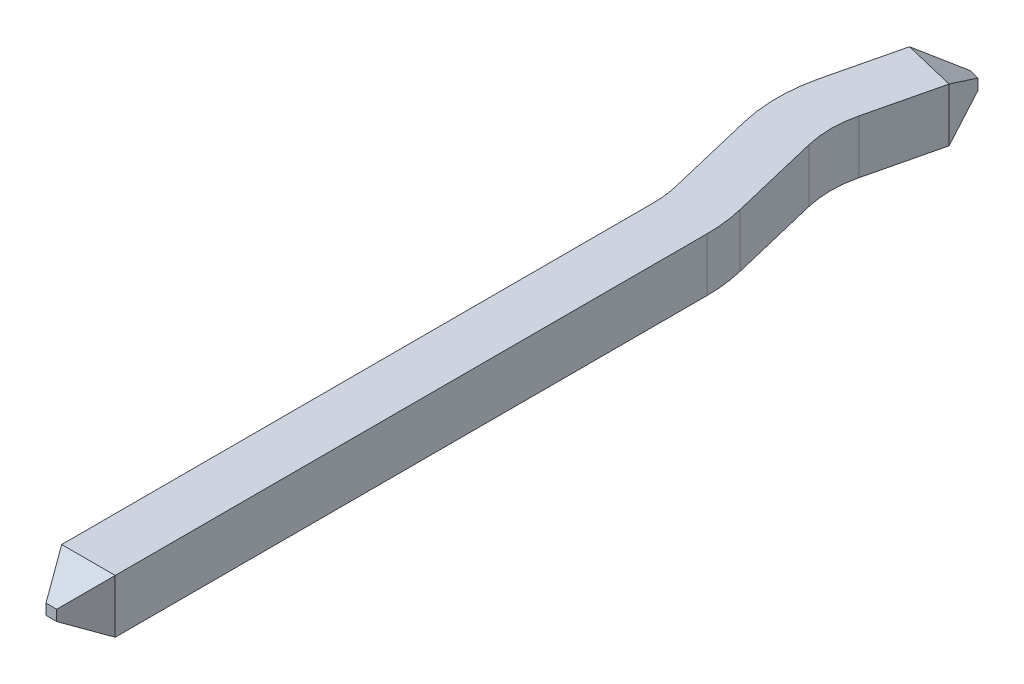
ISO-10303-21;
HEADER;
FILE_DESCRIPTION(('STEP AP214'),'2;1');
FILE_NAME('part.step','',(''),(''),'','','');
FILE_SCHEMA(('AUTOMOTIVE_DESIGN { 1 0 10303 214 1 1 1 1 }'));
ENDSEC;
DATA;
#1=APPLICATION_CONTEXT('core data for automotive mechanical design processes');
#2=APPLICATION_PROTOCOL_DEFINITION('international standard','automotive_design',2000,#1);
#3=PRODUCT_CONTEXT('',#1,'mechanical');
#4=PRODUCT('Part','Part','',(#3));
#5=PRODUCT_RELATED_PRODUCT_CATEGORY('part','',(#4));
#6=PRODUCT_DEFINITION_FORMATION('','',#4);
#7=PRODUCT_DEFINITION_CONTEXT('part definition',#1,'design');
#8=PRODUCT_DEFINITION('design','',#6,#7);
#9=PRODUCT_DEFINITION_SHAPE('','',#8);
#10=(LENGTH_UNIT() NAMED_UNIT(*) SI_UNIT(.MILLI.,.METRE.));
#11=(NAMED_UNIT(*) PLANE_ANGLE_UNIT() SI_UNIT($,.RADIAN.));
#12=(NAMED_UNIT(*) SI_UNIT($,.STERADIAN.) SOLID_ANGLE_UNIT());
#13=UNCERTAINTY_MEASURE_WITH_UNIT(LENGTH_MEASURE(1.E-05),#10,'distance_accuracy_value','');
#14=(GEOMETRIC_REPRESENTATION_CONTEXT(3) GLOBAL_UNCERTAINTY_ASSIGNED_CONTEXT((#13)) GLOBAL_UNIT_ASSIGNED_CONTEXT((#10,
#11,#12)) REPRESENTATION_CONTEXT('',''));
#15=CARTESIAN_POINT('',(0.,0.,0.));
#16=DIRECTION('',(0.,0.,1.));
#17=DIRECTION('',(1.,0.,0.));
#18=AXIS2_PLACEMENT_3D('',#15,#16,#17);
#19=CARTESIAN_POINT('',(0.,-0.05,-2.5));
#20=DIRECTION('',(0.116686476238054,-0.866025403784404,-0.486193650990227));
#21=DIRECTION('',(0.,0.489537781242464,-0.871982087394119));
#22=AXIS2_PLACEMENT_3D('',#19,#20,#21);
#23=PLANE('',#22);
#24=DIRECTION('',(-0.254094909858439,0.447213595500052,-0.857575522495801));
#25=VECTOR('',#24,1.);
#26=CARTESIAN_POINT('',(-0.0808427621599936,-0.25,-2.16315515766698));
#27=LINE('',#26,#25);
#28=CARTESIAN_POINT('',(-0.0808427621601337,-0.25,-2.16315515766704));
#29=VERTEX_POINT('',#28);
#30=CARTESIAN_POINT('',(-0.194477460396004,-0.0500000000000001,-2.54667459049498));
#31=VERTEX_POINT('',#30);
#32=EDGE_CURVE('E131',#29,#31,#27,.T.);
#33=ORIENTED_EDGE('',*,*,#32,.F.);
#34=DIRECTION('',(-0.972387301980345,0.,-0.233372952476041));
#35=VECTOR('',#34,1.);
#36=CARTESIAN_POINT('',(-0.08084276215992,-0.25,-2.163155157667));
#37=LINE('',#36,#35);
#38=CARTESIAN_POINT('',(-0.567036413150236,-0.25,-2.27984163390506));
#39=VERTEX_POINT('',#38);
#40=EDGE_CURVE('E188',#29,#39,#37,.T.);
#41=ORIENTED_EDGE('',*,*,#40,.T.);
#42=DIRECTION('',(0.615634733215566,0.447213595499943,-0.648840408157979));
#43=VECTOR('',#42,1.);
#44=CARTESIAN_POINT('',(-0.56703641315,-0.25,-2.279841633905));
#45=LINE('',#44,#43);
#46=CARTESIAN_POINT('',(-0.291716190594043,-0.0500000000000001,-2.57001188574282));
#47=VERTEX_POINT('',#46);
#48=EDGE_CURVE('E134',#39,#47,#45,.T.);
#49=ORIENTED_EDGE('',*,*,#48,.T.);
#50=DIRECTION('',(-0.972387301980617,0.,-0.233372952474908));
#51=VECTOR('',#50,1.);
#52=CARTESIAN_POINT('',(0.,-0.0500000000000001,-2.5));
#53=LINE('',#52,#51);
#54=EDGE_CURVE('E127',#31,#47,#53,.T.);
#55=ORIENTED_EDGE('',*,*,#54,.F.);
#56=EDGE_LOOP('',(#33,#41,#49,#55));
#57=FACE_BOUND('',#56,.T.);
#58=ADVANCED_FACE('F17',(#57),#23,.T.);
#59=CARTESIAN_POINT('',(0.,-0.25,5.703589838486));
#60=DIRECTION('',(0.,0.866025403784329,-0.50000000000019));
#61=DIRECTION('',(0.,0.50000000000019,0.866025403784329));
#62=AXIS2_PLACEMENT_3D('',#59,#60,#61);
#63=PLANE('',#62);
#64=DIRECTION('',(-1.,0.,0.));
#65=VECTOR('',#64,1.);
#66=CARTESIAN_POINT('',(0.,-0.05,6.05));
#67=LINE('',#66,#65);
#68=CARTESIAN_POINT('',(-0.200000000000116,-0.05,6.04999999999993));
#69=VERTEX_POINT('',#68);
#70=CARTESIAN_POINT('',(-0.3,-0.05,6.05));
#71=VERTEX_POINT('',#70);
#72=EDGE_CURVE('E157',#69,#71,#67,.T.);
#73=ORIENTED_EDGE('',*,*,#72,.T.);
#74=DIRECTION('',(0.447213595500171,0.447213595499784,0.774596669241461));
#75=VECTOR('',#74,1.);
#76=CARTESIAN_POINT('',(-0.500000000000173,-0.25,5.7035898384861));
#77=LINE('',#76,#75);
#78=CARTESIAN_POINT('',(-0.500000000000043,-0.25,5.70358983848602));
#79=VERTEX_POINT('',#78);
#80=EDGE_CURVE('E160',#79,#71,#77,.T.);
#81=ORIENTED_EDGE('',*,*,#80,.F.);
#82=DIRECTION('',(1.,0.,0.));
#83=VECTOR('',#82,1.);
#84=CARTESIAN_POINT('',(0.,-0.25,5.703589838486));
#85=LINE('',#84,#83);
#86=CARTESIAN_POINT('',(0.,-0.25,5.703589838486));
#87=VERTEX_POINT('',#86);
#88=EDGE_CURVE('E99',#79,#87,#85,.T.);
#89=ORIENTED_EDGE('',*,*,#88,.T.);
#90=DIRECTION('',(-0.447213595500171,0.447213595499784,0.774596669241461));
#91=VECTOR('',#90,1.);
#92=CARTESIAN_POINT('',(0.,-0.25,5.703589838486));
#93=LINE('',#92,#91);
#94=EDGE_CURVE('E217',#87,#69,#93,.T.);
#95=ORIENTED_EDGE('',*,*,#94,.T.);
#96=EDGE_LOOP('',(#73,#81,#89,#95));
#97=FACE_BOUND('',#96,.T.);
#98=ADVANCED_FACE('F265',(#97),#63,.F.);
#99=CARTESIAN_POINT('',(0.,0.25,-2.5));
#100=DIRECTION('',(0.233372952474908,0.,-0.972387301980617));
#101=DIRECTION('',(-0.972387301980617,0.,-0.233372952474908));
#102=AXIS2_PLACEMENT_3D('',#99,#100,#101);
#103=PLANE('',#102);
#104=DIRECTION('',(0.,1.,0.));
#105=VECTOR('',#104,1.);
#106=CARTESIAN_POINT('',(-0.194477460396,0.25,-2.546674590495));
#107=LINE('',#106,#105);
#108=CARTESIAN_POINT('',(-0.194477460395994,0.0500000000000671,-2.54667459049502));
#109=VERTEX_POINT('',#108);
#110=EDGE_CURVE('E138',#31,#109,#107,.T.);
#111=ORIENTED_EDGE('',*,*,#110,.F.);
#112=ORIENTED_EDGE('',*,*,#54,.T.);
#113=DIRECTION('',(0.,1.,0.));
#114=VECTOR('',#113,1.);
#115=CARTESIAN_POINT('',(-0.291716190594,0.25,-2.570011885743));
#116=LINE('',#115,#114);
#117=CARTESIAN_POINT('',(-0.291716190594009,0.0499999999998985,-2.57001188574296));
#118=VERTEX_POINT('',#117);
#119=EDGE_CURVE('E145',#47,#118,#116,.T.);
#120=ORIENTED_EDGE('',*,*,#119,.T.);
#121=DIRECTION('',(0.972387301979655,1.68505346394882E-12,0.233372952478918));
#122=VECTOR('',#121,1.);
#123=CARTESIAN_POINT('',(-0.291716190594014,0.0499999999998985,-2.57001188574294));
#124=LINE('',#123,#122);
#125=EDGE_CURVE('E141',#118,#109,#124,.T.);
#126=ORIENTED_EDGE('',*,*,#125,.T.);
#127=EDGE_LOOP('',(#111,#112,#120,#126));
#128=FACE_BOUND('',#127,.T.);
#129=ADVANCED_FACE('F139',(#128),#103,.T.);
#130=CARTESIAN_POINT('',(-0.194477460396,0.25,-2.546674590495));
#131=DIRECTION('',(0.958798582070307,0.,-0.284086745590091));
#132=DIRECTION('',(-0.284086745590091,0.,-0.958798582070307));
#133=AXIS2_PLACEMENT_3D('',#130,#131,#132);
#134=PLANE('',#133);
#135=ORIENTED_EDGE('',*,*,#32,.T.);
#136=ORIENTED_EDGE('',*,*,#110,.T.);
#137=DIRECTION('',(0.254094909858584,0.447213595499902,0.857575522495837));
#138=VECTOR('',#137,1.);
#139=CARTESIAN_POINT('',(-0.194477460395991,0.0500000000000671,-2.54667459049504));
#140=LINE('',#139,#138);
#141=CARTESIAN_POINT('',(-0.0808427621600177,0.25,-2.16315515766702));
#142=VERTEX_POINT('',#141);
#143=EDGE_CURVE('E246',#109,#142,#140,.T.);
#144=ORIENTED_EDGE('',*,*,#143,.T.);
#145=DIRECTION('',(0.,1.,0.));
#146=VECTOR('',#145,1.);
#147=CARTESIAN_POINT('',(-0.0808427621603106,0.25,-2.16315515766709));
#148=LINE('',#147,#146);
#149=EDGE_CURVE('E149',#142,#29,#148,.F.);
#150=ORIENTED_EDGE('',*,*,#149,.T.);
#151=EDGE_LOOP('',(#135,#136,#144,#150));
#152=FACE_BOUND('',#151,.T.);
#153=ADVANCED_FACE('F147',(#152),#134,.T.);
#154=CARTESIAN_POINT('',(-0.56703641315,0.25,-2.279841633905));
#155=DIRECTION('',(0.725425629594969,0.,0.68830055638997));
#156=DIRECTION('',(0.68830055638997,0.,-0.725425629594969));
#157=AXIS2_PLACEMENT_3D('',#154,#155,#156);
#158=PLANE('',#157);
#159=DIRECTION('',(0.,1.,0.));
#160=VECTOR('',#159,1.);
#161=CARTESIAN_POINT('',(-0.567036413150315,0.25,-2.27984163390508));
#162=LINE('',#161,#160);
#163=CARTESIAN_POINT('',(-0.567036413150079,0.250000000000002,-2.27984163390502));
#164=VERTEX_POINT('',#163);
#165=EDGE_CURVE('E234',#164,#39,#162,.F.);
#166=ORIENTED_EDGE('',*,*,#165,.F.);
#167=DIRECTION('',(0.615634733215533,-0.447213595500188,-0.648840408157841));
#168=VECTOR('',#167,1.);
#169=CARTESIAN_POINT('',(-0.567036413149999,0.250000000000008,-2.279841633905));
#170=LINE('',#169,#168);
#171=EDGE_CURVE('E249',#164,#118,#170,.T.);
#172=ORIENTED_EDGE('',*,*,#171,.T.);
#173=ORIENTED_EDGE('',*,*,#119,.F.);
#174=ORIENTED_EDGE('',*,*,#48,.F.);
#175=EDGE_LOOP('',(#166,#172,#173,#174));
#176=FACE_BOUND('',#175,.T.);
#177=ADVANCED_FACE('F342',(#176),#158,.F.);
#178=CARTESIAN_POINT('',(-0.3,0.25,6.05));
#179=DIRECTION('',(-0.866025403784329,0.,0.50000000000019));
#180=DIRECTION('',(0.50000000000019,0.,0.866025403784329));
#181=AXIS2_PLACEMENT_3D('',#178,#179,#180);
#182=PLANE('',#181);
#183=ORIENTED_EDGE('',*,*,#80,.T.);
#184=DIRECTION('',(0.,1.,0.));
#185=VECTOR('',#184,1.);
#186=CARTESIAN_POINT('',(-0.3,0.25,6.05));
#187=LINE('',#186,#185);
#188=CARTESIAN_POINT('',(-0.3,0.05,6.05));
#189=VERTEX_POINT('',#188);
#190=EDGE_CURVE('E159',#71,#189,#187,.T.);
#191=ORIENTED_EDGE('',*,*,#190,.T.);
#192=DIRECTION('',(0.447213595499784,-0.447213595500171,0.774596669241461));
#193=VECTOR('',#192,1.);
#194=CARTESIAN_POINT('',(-0.5,0.250000000000173,5.7035898384861));
#195=LINE('',#194,#193);
#196=CARTESIAN_POINT('',(-0.5,0.250000000000043,5.70358983848602));
#197=VERTEX_POINT('',#196);
#198=EDGE_CURVE('E209',#197,#189,#195,.T.);
#199=ORIENTED_EDGE('',*,*,#198,.F.);
#200=DIRECTION('',(0.,1.,0.));
#201=VECTOR('',#200,1.);
#202=CARTESIAN_POINT('',(-0.5,0.25,5.703589838486));
#203=LINE('',#202,#201);
#204=EDGE_CURVE('E222',#79,#197,#203,.T.);
#205=ORIENTED_EDGE('',*,*,#204,.F.);
#206=EDGE_LOOP('',(#183,#191,#199,#205));
#207=FACE_BOUND('',#206,.T.);
#208=ADVANCED_FACE('F280',(#207),#182,.T.);
#209=CARTESIAN_POINT('',(0.,0.25,6.05));
#210=DIRECTION('',(0.,0.,-1.));
#211=DIRECTION('',(-1.,0.,0.));
#212=AXIS2_PLACEMENT_3D('',#209,#210,#211);
#213=PLANE('',#212);
#214=ORIENTED_EDGE('',*,*,#190,.F.);
#215=ORIENTED_EDGE('',*,*,#72,.F.);
#216=DIRECTION('',(0.,1.,0.));
#217=VECTOR('',#216,1.);
#218=CARTESIAN_POINT('',(-0.200000000000173,0.25,6.0499999999999));
#219=LINE('',#218,#217);
#220=CARTESIAN_POINT('',(-0.200000000000058,0.05,6.04999999999997));
#221=VERTEX_POINT('',#220);
#222=EDGE_CURVE('E194',#69,#221,#219,.T.);
#223=ORIENTED_EDGE('',*,*,#222,.T.);
#224=DIRECTION('',(1.,0.,0.));
#225=VECTOR('',#224,1.);
#226=CARTESIAN_POINT('',(0.,0.05,6.05));
#227=LINE('',#226,#225);
#228=EDGE_CURVE('E205',#189,#221,#227,.T.);
#229=ORIENTED_EDGE('',*,*,#228,.F.);
#230=EDGE_LOOP('',(#214,#215,#223,#229));
#231=FACE_BOUND('',#230,.T.);
#232=ADVANCED_FACE('F276',(#231),#213,.F.);
#233=CARTESIAN_POINT('',(0.,-0.25,6.05));
#234=DIRECTION('',(0.,1.,0.));
#235=DIRECTION('',(0.,0.,1.));
#236=AXIS2_PLACEMENT_3D('',#233,#234,#235);
#237=PLANE('',#236);
#238=ORIENTED_EDGE('',*,*,#40,.F.);
#239=DIRECTION('',(-0.233372952474908,0.,0.972387301980617));
#240=VECTOR('',#239,1.);
#241=CARTESIAN_POINT('',(-0.3,-0.25,-1.25));
#242=LINE('',#241,#240);
#243=CARTESIAN_POINT('',(-0.243990491405859,-0.25,-1.48337295247497));
#244=VERTEX_POINT('',#243);
#245=EDGE_CURVE('E247',#29,#244,#242,.T.);
#246=ORIENTED_EDGE('',*,*,#245,.T.);
#247=CARTESIAN_POINT('',(0.728396810575,-0.25,-1.25));
#248=DIRECTION('',(0.,1.,0.));
#249=DIRECTION('',(0.,0.,1.));
#250=AXIS2_PLACEMENT_3D('',#247,#248,#249);
#251=CIRCLE('',#250,1.);
#252=CARTESIAN_POINT('',(-0.243990491405751,-0.25,-1.01662704752481));
#253=VERTEX_POINT('',#252);
#254=EDGE_CURVE('E187',#253,#244,#251,.F.);
#255=ORIENTED_EDGE('',*,*,#254,.F.);
#256=DIRECTION('',(-0.233372952475389,0.,-0.972387301980502));
#257=VECTOR('',#256,1.);
#258=CARTESIAN_POINT('',(-0.04141904702922,-0.25,-0.172579362622));
#259=LINE('',#258,#257);
#260=CARTESIAN_POINT('',(-0.0414190470292217,-0.25,-0.172579362622045));
#261=VERTEX_POINT('',#260);
#262=EDGE_CURVE('E189',#261,#253,#259,.T.);
#263=ORIENTED_EDGE('',*,*,#262,.F.);
#264=CARTESIAN_POINT('',(-1.5,-0.25,0.177480066091));
#265=DIRECTION('',(0.,1.,0.));
#266=DIRECTION('',(0.,0.,1.));
#267=AXIS2_PLACEMENT_3D('',#264,#265,#266);
#268=CIRCLE('',#267,1.5);
#269=CARTESIAN_POINT('',(0.,-0.25,0.177480066091));
#270=VERTEX_POINT('',#269);
#271=EDGE_CURVE('E20',#270,#261,#268,.T.);
#272=ORIENTED_EDGE('',*,*,#271,.F.);
#273=DIRECTION('',(0.,0.,1.));
#274=VECTOR('',#273,1.);
#275=CARTESIAN_POINT('',(0.,-0.25,6.05));
#276=LINE('',#275,#274);
#277=EDGE_CURVE('E208',#270,#87,#276,.T.);
#278=ORIENTED_EDGE('',*,*,#277,.T.);
#279=ORIENTED_EDGE('',*,*,#88,.F.);
#280=DIRECTION('',(0.,0.,1.));
#281=VECTOR('',#280,1.);
#282=CARTESIAN_POINT('',(-0.5,-0.25,6.05));
#283=LINE('',#282,#281);
#284=CARTESIAN_POINT('',(-0.5,-0.25,0.177480066091));
#285=VERTEX_POINT('',#284);
#286=EDGE_CURVE('E181',#285,#79,#283,.T.);
#287=ORIENTED_EDGE('',*,*,#286,.F.);
#288=CARTESIAN_POINT('',(-1.5,-0.25,0.177480066091));
#289=DIRECTION('',(0.,1.,0.));
#290=DIRECTION('',(0.,0.,1.));
#291=AXIS2_PLACEMENT_3D('',#288,#289,#290);
#292=CIRCLE('',#291,1.);
#293=CARTESIAN_POINT('',(-0.527612698019298,-0.25,-0.0558928863839784));
#294=VERTEX_POINT('',#293);
#295=EDGE_CURVE('E178',#285,#294,#292,.T.);
#296=ORIENTED_EDGE('',*,*,#295,.T.);
#297=DIRECTION('',(0.233372952474908,0.,0.972387301980617));
#298=VECTOR('',#297,1.);
#299=CARTESIAN_POINT('',(-0.48619365099,-0.25,0.116686476238));
#300=LINE('',#299,#298);
#301=CARTESIAN_POINT('',(-0.730184142395635,-0.25,-0.899940571287397));
#302=VERTEX_POINT('',#301);
#303=EDGE_CURVE('E229',#302,#294,#300,.T.);
#304=ORIENTED_EDGE('',*,*,#303,.F.);
#305=CARTESIAN_POINT('',(0.728396810575,-0.25,-1.25));
#306=DIRECTION('',(0.,1.,0.));
#307=DIRECTION('',(0.,0.,1.));
#308=AXIS2_PLACEMENT_3D('',#305,#306,#307);
#309=CIRCLE('',#308,1.5);
#310=CARTESIAN_POINT('',(-0.730184142396013,-0.25,-1.60005942871269));
#311=VERTEX_POINT('',#310);
#312=EDGE_CURVE('E183',#311,#302,#309,.T.);
#313=ORIENTED_EDGE('',*,*,#312,.F.);
#314=DIRECTION('',(-0.233372952474908,0.,0.972387301980617));
#315=VECTOR('',#314,1.);
#316=CARTESIAN_POINT('',(-0.78619365099,-0.25,-1.366686476238));
#317=LINE('',#316,#315);
#318=EDGE_CURVE('E186',#39,#311,#317,.T.);
#319=ORIENTED_EDGE('',*,*,#318,.F.);
#320=EDGE_LOOP('',(#238,#246,#255,#263,#272,#278,#279,#287,#296,#304,#313,#319));
#321=FACE_BOUND('',#320,.T.);
#322=ADVANCED_FACE('F283',(#321),#237,.F.);
#323=CARTESIAN_POINT('',(0.,0.25,5.703589838486));
#324=DIRECTION('',(-0.866025403784329,0.,-0.50000000000019));
#325=DIRECTION('',(-0.50000000000019,0.,0.866025403784329));
#326=AXIS2_PLACEMENT_3D('',#323,#324,#325);
#327=PLANE('',#326);
#328=DIRECTION('',(0.,1.,0.));
#329=VECTOR('',#328,1.);
#330=CARTESIAN_POINT('',(0.,0.25,5.703589838486));
#331=LINE('',#330,#329);
#332=CARTESIAN_POINT('',(0.,0.250000000000043,5.70358983848602));
#333=VERTEX_POINT('',#332);
#334=EDGE_CURVE('E261',#87,#333,#331,.T.);
#335=ORIENTED_EDGE('',*,*,#334,.T.);
#336=DIRECTION('',(0.447213595499784,0.447213595500171,-0.774596669241461));
#337=VECTOR('',#336,1.);
#338=CARTESIAN_POINT('',(-0.2,0.05,6.05));
#339=LINE('',#338,#337);
#340=EDGE_CURVE('E272',#221,#333,#339,.T.);
#341=ORIENTED_EDGE('',*,*,#340,.F.);
#342=ORIENTED_EDGE('',*,*,#222,.F.);
#343=ORIENTED_EDGE('',*,*,#94,.F.);
#344=EDGE_LOOP('',(#335,#341,#342,#343));
#345=FACE_BOUND('',#344,.T.);
#346=ADVANCED_FACE('F270',(#345),#327,.F.);
#347=CARTESIAN_POINT('',(-0.3,0.25,-1.25));
#348=DIRECTION('',(-0.972387301980617,0.,-0.233372952474908));
#349=DIRECTION('',(-0.233372952474908,0.,0.972387301980617));
#350=AXIS2_PLACEMENT_3D('',#347,#348,#349);
#351=PLANE('',#350);
#352=ORIENTED_EDGE('',*,*,#149,.F.);
#353=DIRECTION('',(0.233372952475324,0.,-0.972387301980517));
#354=VECTOR('',#353,1.);
#355=CARTESIAN_POINT('',(-0.243990491406,0.25,-1.483372952475));
#356=LINE('',#355,#354);
#357=CARTESIAN_POINT('',(-0.243990491405759,0.25,-1.48337295247516));
#358=VERTEX_POINT('',#357);
#359=EDGE_CURVE('E331',#358,#142,#356,.T.);
#360=ORIENTED_EDGE('',*,*,#359,.F.);
#361=DIRECTION('',(0.,1.,0.));
#362=VECTOR('',#361,1.);
#363=CARTESIAN_POINT('',(-0.243990491405617,0.25,-1.48337295247491));
#364=LINE('',#363,#362);
#365=EDGE_CURVE('E350',#358,#244,#364,.F.);
#366=ORIENTED_EDGE('',*,*,#365,.T.);
#367=ORIENTED_EDGE('',*,*,#245,.F.);
#368=EDGE_LOOP('',(#352,#360,#366,#367));
#369=FACE_BOUND('',#368,.T.);
#370=ADVANCED_FACE('F349',(#369),#351,.F.);
#371=CARTESIAN_POINT('',(-0.08084276215992,0.25,-2.163155157667));
#372=DIRECTION('',(-0.116686476238054,-0.866025403784404,0.486193650990227));
#373=DIRECTION('',(0.,-0.489537781242464,-0.871982087394119));
#374=AXIS2_PLACEMENT_3D('',#371,#372,#373);
#375=PLANE('',#374);
#376=DIRECTION('',(-0.972387301980345,0.,-0.233372952476044));
#377=VECTOR('',#376,1.);
#378=CARTESIAN_POINT('',(-0.08084276215992,0.25,-2.163155157667));
#379=LINE('',#378,#377);
#380=EDGE_CURVE('E328',#142,#164,#379,.T.);
#381=ORIENTED_EDGE('',*,*,#380,.F.);
#382=ORIENTED_EDGE('',*,*,#143,.F.);
#383=ORIENTED_EDGE('',*,*,#125,.F.);
#384=ORIENTED_EDGE('',*,*,#171,.F.);
#385=EDGE_LOOP('',(#381,#382,#383,#384));
#386=FACE_BOUND('',#385,.T.);
#387=ADVANCED_FACE('F346',(#386),#375,.F.);
#388=CARTESIAN_POINT('',(-0.78619365099,0.25,-1.366686476238));
#389=DIRECTION('',(-0.972387301980617,0.,-0.233372952474908));
#390=DIRECTION('',(-0.233372952474908,0.,0.972387301980617));
#391=AXIS2_PLACEMENT_3D('',#388,#389,#390);
#392=PLANE('',#391);
#393=ORIENTED_EDGE('',*,*,#318,.T.);
#394=DIRECTION('',(0.,1.,0.));
#395=VECTOR('',#394,1.);
#396=CARTESIAN_POINT('',(-0.730184142395785,0.25,-1.60005942871295));
#397=LINE('',#396,#395);
#398=CARTESIAN_POINT('',(-0.730184142395907,0.25,-1.60005942871291));
#399=VERTEX_POINT('',#398);
#400=EDGE_CURVE('E185',#399,#311,#397,.F.);
#401=ORIENTED_EDGE('',*,*,#400,.F.);
#402=DIRECTION('',(-0.233372952475216,0.,0.972387301980543));
#403=VECTOR('',#402,1.);
#404=CARTESIAN_POINT('',(-0.56703641315,0.25,-2.279841633905));
#405=LINE('',#404,#403);
#406=EDGE_CURVE('E177',#164,#399,#405,.T.);
#407=ORIENTED_EDGE('',*,*,#406,.F.);
#408=ORIENTED_EDGE('',*,*,#165,.T.);
#409=EDGE_LOOP('',(#393,#401,#407,#408));
#410=FACE_BOUND('',#409,.T.);
#411=ADVANCED_FACE('F464',(#410),#392,.T.);
#412=CARTESIAN_POINT('',(0.728396810575,0.25,-1.25));
#413=DIRECTION('',(0.,1.,0.));
#414=DIRECTION('',(0.,0.,1.));
#415=AXIS2_PLACEMENT_3D('',#412,#413,#414);
#416=CYLINDRICAL_SURFACE('',#415,1.5);
#417=CARTESIAN_POINT('',(0.728396810575,0.25,-1.25));
#418=DIRECTION('',(0.,1.,0.));
#419=DIRECTION('',(0.,0.,1.));
#420=AXIS2_PLACEMENT_3D('',#417,#418,#419);
#421=CIRCLE('',#420,1.5);
#422=CARTESIAN_POINT('',(-0.730184142395718,0.25,-0.899940571286785));
#423=VERTEX_POINT('',#422);
#424=EDGE_CURVE('E174',#399,#423,#421,.T.);
#425=ORIENTED_EDGE('',*,*,#424,.F.);
#426=ORIENTED_EDGE('',*,*,#400,.T.);
#427=ORIENTED_EDGE('',*,*,#312,.T.);
#428=DIRECTION('',(0.,1.,0.));
#429=VECTOR('',#428,1.);
#430=CARTESIAN_POINT('',(-0.730184142395565,0.25,-0.899940571287105));
#431=LINE('',#430,#429);
#432=EDGE_CURVE('E231',#423,#302,#431,.F.);
#433=ORIENTED_EDGE('',*,*,#432,.F.);
#434=EDGE_LOOP('',(#425,#426,#427,#433));
#435=FACE_BOUND('',#434,.T.);
#436=ADVANCED_FACE('F454',(#435),#416,.T.);
#437=CARTESIAN_POINT('',(-0.48619365099,0.25,0.116686476238));
#438=DIRECTION('',(-0.972387301980617,0.,0.233372952474908));
#439=DIRECTION('',(0.233372952474908,0.,0.972387301980617));
#440=AXIS2_PLACEMENT_3D('',#437,#438,#439);
#441=PLANE('',#440);
#442=DIRECTION('',(0.233372952475655,0.,0.972387301980438));
#443=VECTOR('',#442,1.);
#444=CARTESIAN_POINT('',(-0.730184142396,0.25,-0.899940571287));
#445=LINE('',#444,#443);
#446=CARTESIAN_POINT('',(-0.527612698019281,0.25,-0.0558928863843777));
#447=VERTEX_POINT('',#446);
#448=EDGE_CURVE('E173',#423,#447,#445,.T.);
#449=ORIENTED_EDGE('',*,*,#448,.F.);
#450=ORIENTED_EDGE('',*,*,#432,.T.);
#451=ORIENTED_EDGE('',*,*,#303,.T.);
#452=DIRECTION('',(0.,1.,0.));
#453=VECTOR('',#452,1.);
#454=CARTESIAN_POINT('',(-0.527612698019405,0.25,-0.0558928863840027));
#455=LINE('',#454,#453);
#456=EDGE_CURVE('E182',#294,#447,#455,.T.);
#457=ORIENTED_EDGE('',*,*,#456,.T.);
#458=EDGE_LOOP('',(#449,#450,#451,#457));
#459=FACE_BOUND('',#458,.T.);
#460=ADVANCED_FACE('F444',(#459),#441,.T.);
#461=CARTESIAN_POINT('',(-1.5,0.25,0.177480066091));
#462=DIRECTION('',(0.,1.,0.));
#463=DIRECTION('',(0.,0.,1.));
#464=AXIS2_PLACEMENT_3D('',#461,#462,#463);
#465=CYLINDRICAL_SURFACE('',#464,1.);
#466=DIRECTION('',(0.,1.,0.));
#467=VECTOR('',#466,1.);
#468=CARTESIAN_POINT('',(-0.5,0.25,0.177480066091));
#469=LINE('',#468,#467);
#470=CARTESIAN_POINT('',(-0.5,0.25,0.177480066091));
#471=VERTEX_POINT('',#470);
#472=EDGE_CURVE('E308',#471,#285,#469,.F.);
#473=ORIENTED_EDGE('',*,*,#472,.F.);
#474=CARTESIAN_POINT('',(-1.5,0.25,0.177480066091));
#475=DIRECTION('',(0.,1.,0.));
#476=DIRECTION('',(0.,0.,1.));
#477=AXIS2_PLACEMENT_3D('',#474,#475,#476);
#478=CIRCLE('',#477,1.);
#479=EDGE_CURVE('E169',#447,#471,#478,.F.);
#480=ORIENTED_EDGE('',*,*,#479,.F.);
#481=ORIENTED_EDGE('',*,*,#456,.F.);
#482=ORIENTED_EDGE('',*,*,#295,.F.);
#483=EDGE_LOOP('',(#473,#480,#481,#482));
#484=FACE_BOUND('',#483,.T.);
#485=ADVANCED_FACE('F434',(#484),#465,.F.);
#486=CARTESIAN_POINT('',(-0.5,0.25,6.05));
#487=DIRECTION('',(-1.,0.,0.));
#488=DIRECTION('',(0.,0.,1.));
#489=AXIS2_PLACEMENT_3D('',#486,#487,#488);
#490=PLANE('',#489);
#491=DIRECTION('',(0.,0.,1.));
#492=VECTOR('',#491,1.);
#493=CARTESIAN_POINT('',(-0.5,0.25,-1.25));
#494=LINE('',#493,#492);
#495=EDGE_CURVE('E172',#471,#197,#494,.T.);
#496=ORIENTED_EDGE('',*,*,#495,.F.);
#497=ORIENTED_EDGE('',*,*,#472,.T.);
#498=ORIENTED_EDGE('',*,*,#286,.T.);
#499=ORIENTED_EDGE('',*,*,#204,.T.);
#500=EDGE_LOOP('',(#496,#497,#498,#499));
#501=FACE_BOUND('',#500,.T.);
#502=ADVANCED_FACE('F424',(#501),#490,.T.);
#503=CARTESIAN_POINT('',(0.,0.05,6.05));
#504=DIRECTION('',(0.,0.866025403784329,0.50000000000019));
#505=DIRECTION('',(0.,-0.50000000000019,0.866025403784329));
#506=AXIS2_PLACEMENT_3D('',#503,#504,#505);
#507=PLANE('',#506);
#508=ORIENTED_EDGE('',*,*,#198,.T.);
#509=ORIENTED_EDGE('',*,*,#228,.T.);
#510=ORIENTED_EDGE('',*,*,#340,.T.);
#511=DIRECTION('',(1.,0.,0.));
#512=VECTOR('',#511,1.);
#513=CARTESIAN_POINT('',(-0.3,0.25,5.703589838486));
#514=LINE('',#513,#512);
#515=EDGE_CURVE('E302',#197,#333,#514,.T.);
#516=ORIENTED_EDGE('',*,*,#515,.F.);
#517=EDGE_LOOP('',(#508,#509,#510,#516));
#518=FACE_BOUND('',#517,.T.);
#519=ADVANCED_FACE('F415',(#518),#507,.T.);
#520=CARTESIAN_POINT('',(0.,0.25,6.05));
#521=DIRECTION('',(-1.,0.,0.));
#522=DIRECTION('',(0.,0.,1.));
#523=AXIS2_PLACEMENT_3D('',#520,#521,#522);
#524=PLANE('',#523);
#525=ORIENTED_EDGE('',*,*,#334,.F.);
#526=ORIENTED_EDGE('',*,*,#277,.F.);
#527=DIRECTION('',(0.,1.,0.));
#528=VECTOR('',#527,1.);
#529=CARTESIAN_POINT('',(0.,0.25,0.177480066091));
#530=LINE('',#529,#528);
#531=CARTESIAN_POINT('',(0.,0.25,0.177480066091));
#532=VERTEX_POINT('',#531);
#533=EDGE_CURVE('E289',#532,#270,#530,.F.);
#534=ORIENTED_EDGE('',*,*,#533,.F.);
#535=DIRECTION('',(0.,0.,1.));
#536=VECTOR('',#535,1.);
#537=CARTESIAN_POINT('',(0.,0.25,-1.25));
#538=LINE('',#537,#536);
#539=EDGE_CURVE('E168',#333,#532,#538,.F.);
#540=ORIENTED_EDGE('',*,*,#539,.F.);
#541=EDGE_LOOP('',(#525,#526,#534,#540));
#542=FACE_BOUND('',#541,.T.);
#543=ADVANCED_FACE('F287',(#542),#524,.F.);
#544=CARTESIAN_POINT('',(-1.5,0.25,0.177480066091));
#545=DIRECTION('',(0.,1.,0.));
#546=DIRECTION('',(0.,0.,1.));
#547=AXIS2_PLACEMENT_3D('',#544,#545,#546);
#548=CYLINDRICAL_SURFACE('',#547,1.5);
#549=CARTESIAN_POINT('',(-1.5,0.25,0.177480066091));
#550=DIRECTION('',(0.,1.,0.));
#551=DIRECTION('',(0.,0.,1.));
#552=AXIS2_PLACEMENT_3D('',#549,#550,#551);
#553=CIRCLE('',#552,1.5);
#554=CARTESIAN_POINT('',(-0.0414190470292217,0.25,-0.172579362622045));
#555=VERTEX_POINT('',#554);
#556=EDGE_CURVE('E165',#532,#555,#553,.T.);
#557=ORIENTED_EDGE('',*,*,#556,.F.);
#558=ORIENTED_EDGE('',*,*,#533,.T.);
#559=ORIENTED_EDGE('',*,*,#271,.T.);
#560=DIRECTION('',(0.,1.,0.));
#561=VECTOR('',#560,1.);
#562=CARTESIAN_POINT('',(-0.0414190470292029,0.25,-0.172579362622004));
#563=LINE('',#562,#561);
#564=EDGE_CURVE('E294',#261,#555,#563,.T.);
#565=ORIENTED_EDGE('',*,*,#564,.T.);
#566=EDGE_LOOP('',(#557,#558,#559,#565));
#567=FACE_BOUND('',#566,.T.);
#568=ADVANCED_FACE('F292',(#567),#548,.T.);
#569=CARTESIAN_POINT('',(0.,0.25,0.));
#570=DIRECTION('',(-0.972387301980617,0.,0.233372952474908));
#571=DIRECTION('',(0.233372952474908,0.,0.972387301980617));
#572=AXIS2_PLACEMENT_3D('',#569,#570,#571);
#573=PLANE('',#572);
#574=DIRECTION('',(0.,1.,0.));
#575=VECTOR('',#574,1.);
#576=CARTESIAN_POINT('',(-0.243990491405617,0.25,-1.01662704752509));
#577=LINE('',#576,#575);
#578=CARTESIAN_POINT('',(-0.243990491405751,0.25,-1.01662704752481));
#579=VERTEX_POINT('',#578);
#580=EDGE_CURVE('E35',#253,#579,#577,.T.);
#581=ORIENTED_EDGE('',*,*,#580,.T.);
#582=DIRECTION('',(-0.233372952475389,0.,-0.972387301980502));
#583=VECTOR('',#582,1.);
#584=CARTESIAN_POINT('',(-0.04141904702922,0.25,-0.172579362622));
#585=LINE('',#584,#583);
#586=EDGE_CURVE('E26',#555,#579,#585,.T.);
#587=ORIENTED_EDGE('',*,*,#586,.F.);
#588=ORIENTED_EDGE('',*,*,#564,.F.);
#589=ORIENTED_EDGE('',*,*,#262,.T.);
#590=EDGE_LOOP('',(#581,#587,#588,#589));
#591=FACE_BOUND('',#590,.T.);
#592=ADVANCED_FACE('F372',(#591),#573,.F.);
#593=CARTESIAN_POINT('',(0.728396810575,0.25,-1.25));
#594=DIRECTION('',(0.,1.,0.));
#595=DIRECTION('',(0.,0.,1.));
#596=AXIS2_PLACEMENT_3D('',#593,#594,#595);
#597=CYLINDRICAL_SURFACE('',#596,1.);
#598=ORIENTED_EDGE('',*,*,#365,.F.);
#599=CARTESIAN_POINT('',(0.728396810575,0.25,-1.25));
#600=DIRECTION('',(0.,1.,0.));
#601=DIRECTION('',(0.,0.,1.));
#602=AXIS2_PLACEMENT_3D('',#599,#600,#601);
#603=CIRCLE('',#602,1.);
#604=EDGE_CURVE('E11',#579,#358,#603,.F.);
#605=ORIENTED_EDGE('',*,*,#604,.F.);
#606=ORIENTED_EDGE('',*,*,#580,.F.);
#607=ORIENTED_EDGE('',*,*,#254,.T.);
#608=EDGE_LOOP('',(#598,#605,#606,#607));
#609=FACE_BOUND('',#608,.T.);
#610=ADVANCED_FACE('F374',(#609),#597,.F.);
#611=CARTESIAN_POINT('',(-0.3,0.25,-1.25));
#612=DIRECTION('',(0.,1.,0.));
#613=DIRECTION('',(0.,0.,1.));
#614=AXIS2_PLACEMENT_3D('',#611,#612,#613);
#615=PLANE('',#614);
#616=ORIENTED_EDGE('',*,*,#586,.T.);
#617=ORIENTED_EDGE('',*,*,#604,.T.);
#618=ORIENTED_EDGE('',*,*,#359,.T.);
#619=ORIENTED_EDGE('',*,*,#380,.T.);
#620=ORIENTED_EDGE('',*,*,#406,.T.);
#621=ORIENTED_EDGE('',*,*,#424,.T.);
#622=ORIENTED_EDGE('',*,*,#448,.T.);
#623=ORIENTED_EDGE('',*,*,#479,.T.);
#624=ORIENTED_EDGE('',*,*,#495,.T.);
#625=ORIENTED_EDGE('',*,*,#515,.T.);
#626=ORIENTED_EDGE('',*,*,#539,.T.);
#627=ORIENTED_EDGE('',*,*,#556,.T.);
#628=EDGE_LOOP('',(#616,#617,#618,#619,#620,#621,#622,#623,#624,#625,#626,#627));
#629=FACE_BOUND('',#628,.T.);
#630=ADVANCED_FACE('F371',(#629),#615,.T.);
#631=CLOSED_SHELL('',(#58,#98,#129,#153,#177,#208,#232,#322,#346,#370,#387,#411,#436,#460,#485,
#502,#519,#543,#568,#592,#610,#630));
#632=MANIFOLD_SOLID_BREP('B1',#631);
#633=ADVANCED_BREP_SHAPE_REPRESENTATION('',(#18,#632),#14);
#634=SHAPE_DEFINITION_REPRESENTATION(#9,#633);
ENDSEC;
END-ISO-10303-21;
